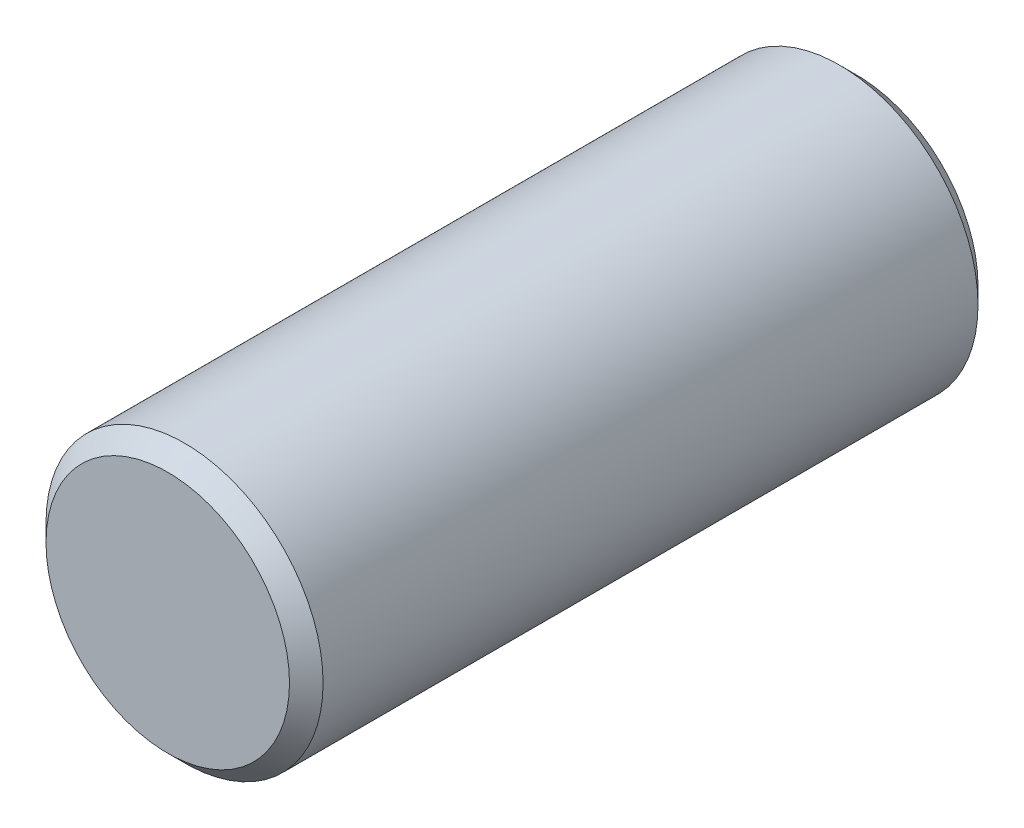
ISO-10303-21;
HEADER;
FILE_DESCRIPTION(('STEP AP214'),'2;1');
FILE_NAME('part.step','',(''),(''),'','','');
FILE_SCHEMA(('AUTOMOTIVE_DESIGN { 1 0 10303 214 1 1 1 1 }'));
ENDSEC;
DATA;
#1=APPLICATION_CONTEXT('core data for automotive mechanical design processes');
#2=APPLICATION_PROTOCOL_DEFINITION('international standard','automotive_design',2000,#1);
#3=PRODUCT_CONTEXT('',#1,'mechanical');
#4=PRODUCT('Part','Part','',(#3));
#5=PRODUCT_RELATED_PRODUCT_CATEGORY('part','',(#4));
#6=PRODUCT_DEFINITION_FORMATION('','',#4);
#7=PRODUCT_DEFINITION_CONTEXT('part definition',#1,'design');
#8=PRODUCT_DEFINITION('design','',#6,#7);
#9=PRODUCT_DEFINITION_SHAPE('','',#8);
#10=(LENGTH_UNIT() NAMED_UNIT(*) SI_UNIT(.MILLI.,.METRE.));
#11=(NAMED_UNIT(*) PLANE_ANGLE_UNIT() SI_UNIT($,.RADIAN.));
#12=(NAMED_UNIT(*) SI_UNIT($,.STERADIAN.) SOLID_ANGLE_UNIT());
#13=UNCERTAINTY_MEASURE_WITH_UNIT(LENGTH_MEASURE(1.E-05),#10,'distance_accuracy_value','');
#14=(GEOMETRIC_REPRESENTATION_CONTEXT(3) GLOBAL_UNCERTAINTY_ASSIGNED_CONTEXT((#13)) GLOBAL_UNIT_ASSIGNED_CONTEXT((#10,
#11,#12)) REPRESENTATION_CONTEXT('',''));
#15=CARTESIAN_POINT('',(0.,0.,0.));
#16=DIRECTION('',(0.,0.,1.));
#17=DIRECTION('',(1.,0.,0.));
#18=AXIS2_PLACEMENT_3D('',#15,#16,#17);
#19=CARTESIAN_POINT('',(0.,0.,41.));
#20=DIRECTION('',(0.,0.,-1.));
#21=DIRECTION('',(-1.,0.,0.));
#22=AXIS2_PLACEMENT_3D('',#19,#20,#21);
#23=CYLINDRICAL_SURFACE('',#22,16.5);
#24=CARTESIAN_POINT('',(0.,0.,-39.));
#25=DIRECTION('',(0.,0.,1.));
#26=DIRECTION('',(1.,0.,0.));
#27=AXIS2_PLACEMENT_3D('',#24,#25,#26);
#28=CIRCLE('',#27,16.5);
#29=CARTESIAN_POINT('',(16.5,0.,-39.));
#30=VERTEX_POINT('',#29);
#31=EDGE_CURVE('E50',#30,#30,#28,.T.);
#32=ORIENTED_EDGE('',*,*,#31,.T.);
#33=EDGE_LOOP('',(#32));
#34=FACE_BOUND('',#33,.T.);
#35=CARTESIAN_POINT('',(0.,0.,39.));
#36=DIRECTION('',(0.,0.,1.));
#37=DIRECTION('',(1.,0.,0.));
#38=AXIS2_PLACEMENT_3D('',#35,#36,#37);
#39=CIRCLE('',#38,16.5);
#40=CARTESIAN_POINT('',(16.5,0.,39.));
#41=VERTEX_POINT('',#40);
#42=EDGE_CURVE('E55',#41,#41,#39,.F.);
#43=ORIENTED_EDGE('',*,*,#42,.T.);
#44=EDGE_LOOP('',(#43));
#45=FACE_BOUND('',#44,.T.);
#46=ADVANCED_FACE('F37',(#34,#45),#23,.T.);
#47=CARTESIAN_POINT('',(0.,0.,41.));
#48=DIRECTION('',(0.,0.,1.));
#49=DIRECTION('',(1.,0.,0.));
#50=AXIS2_PLACEMENT_3D('',#47,#48,#49);
#51=PLANE('',#50);
#52=CARTESIAN_POINT('',(0.,0.,41.));
#53=DIRECTION('',(0.,0.,1.));
#54=DIRECTION('',(1.,0.,0.));
#55=AXIS2_PLACEMENT_3D('',#52,#53,#54);
#56=CIRCLE('',#55,14.5);
#57=CARTESIAN_POINT('',(14.5,0.,41.));
#58=VERTEX_POINT('',#57);
#59=EDGE_CURVE('E10',#58,#58,#56,.T.);
#60=ORIENTED_EDGE('',*,*,#59,.T.);
#61=EDGE_LOOP('',(#60));
#62=FACE_BOUND('',#61,.T.);
#63=ADVANCED_FACE('F72',(#62),#51,.T.);
#64=CARTESIAN_POINT('',(0.,0.,-41.));
#65=DIRECTION('',(0.,0.,1.));
#66=DIRECTION('',(1.,0.,0.));
#67=AXIS2_PLACEMENT_3D('',#64,#65,#66);
#68=PLANE('',#67);
#69=CARTESIAN_POINT('',(0.,0.,-41.));
#70=DIRECTION('',(0.,0.,1.));
#71=DIRECTION('',(1.,0.,0.));
#72=AXIS2_PLACEMENT_3D('',#69,#70,#71);
#73=CIRCLE('',#72,14.5);
#74=CARTESIAN_POINT('',(14.5,0.,-41.));
#75=VERTEX_POINT('',#74);
#76=EDGE_CURVE('E45',#75,#75,#73,.F.);
#77=ORIENTED_EDGE('',*,*,#76,.T.);
#78=EDGE_LOOP('',(#77));
#79=FACE_BOUND('',#78,.T.);
#80=ADVANCED_FACE('F69',(#79),#68,.F.);
#81=CARTESIAN_POINT('',(0.,0.,-39.));
#82=DIRECTION('',(0.,0.,1.));
#83=DIRECTION('',(1.,0.,0.));
#84=AXIS2_PLACEMENT_3D('',#81,#82,#83);
#85=CONICAL_SURFACE('',#84,16.5,0.785398163397448);
#86=ORIENTED_EDGE('',*,*,#76,.F.);
#87=EDGE_LOOP('',(#86));
#88=FACE_BOUND('',#87,.T.);
#89=ORIENTED_EDGE('',*,*,#31,.F.);
#90=EDGE_LOOP('',(#89));
#91=FACE_BOUND('',#90,.T.);
#92=ADVANCED_FACE('F65',(#88,#91),#85,.T.);
#93=CARTESIAN_POINT('',(0.,0.,41.));
#94=DIRECTION('',(0.,0.,-1.));
#95=DIRECTION('',(-1.,0.,0.));
#96=AXIS2_PLACEMENT_3D('',#93,#94,#95);
#97=CONICAL_SURFACE('',#96,14.5,0.785398163397448);
#98=ORIENTED_EDGE('',*,*,#42,.F.);
#99=EDGE_LOOP('',(#98));
#100=FACE_BOUND('',#99,.T.);
#101=ORIENTED_EDGE('',*,*,#59,.F.);
#102=EDGE_LOOP('',(#101));
#103=FACE_BOUND('',#102,.T.);
#104=ADVANCED_FACE('F39',(#100,#103),#97,.T.);
#105=CLOSED_SHELL('',(#46,#63,#80,#92,#104));
#106=MANIFOLD_SOLID_BREP('B2',#105);
#107=ADVANCED_BREP_SHAPE_REPRESENTATION('',(#18,#106),#14);
#108=SHAPE_DEFINITION_REPRESENTATION(#9,#107);
ENDSEC;
END-ISO-10303-21;
